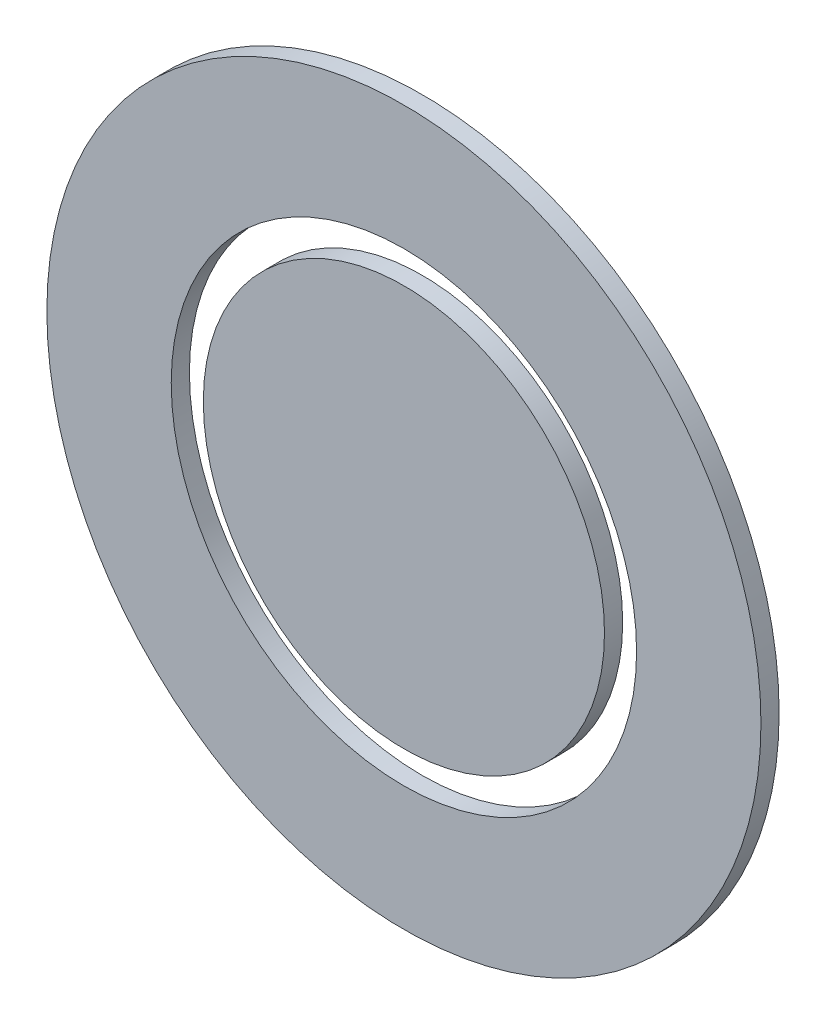
ISO-10303-21;
HEADER;
FILE_DESCRIPTION(('STEP AP214'),'2;1');
FILE_NAME('part.step','',(''),(''),'','','');
FILE_SCHEMA(('AUTOMOTIVE_DESIGN { 1 0 10303 214 1 1 1 1 }'));
ENDSEC;
DATA;
#1=APPLICATION_CONTEXT('core data for automotive mechanical design processes');
#2=APPLICATION_PROTOCOL_DEFINITION('international standard','automotive_design',2000,#1);
#3=PRODUCT_CONTEXT('',#1,'mechanical');
#4=PRODUCT('Part','Part','',(#3));
#5=PRODUCT_RELATED_PRODUCT_CATEGORY('part','',(#4));
#6=PRODUCT_DEFINITION_FORMATION('','',#4);
#7=PRODUCT_DEFINITION_CONTEXT('part definition',#1,'design');
#8=PRODUCT_DEFINITION('design','',#6,#7);
#9=PRODUCT_DEFINITION_SHAPE('','',#8);
#10=(LENGTH_UNIT() NAMED_UNIT(*) SI_UNIT(.MILLI.,.METRE.));
#11=(NAMED_UNIT(*) PLANE_ANGLE_UNIT() SI_UNIT($,.RADIAN.));
#12=(NAMED_UNIT(*) SI_UNIT($,.STERADIAN.) SOLID_ANGLE_UNIT());
#13=UNCERTAINTY_MEASURE_WITH_UNIT(LENGTH_MEASURE(1.E-05),#10,'distance_accuracy_value','');
#14=(GEOMETRIC_REPRESENTATION_CONTEXT(3) GLOBAL_UNCERTAINTY_ASSIGNED_CONTEXT((#13)) GLOBAL_UNIT_ASSIGNED_CONTEXT((#10,
#11,#12)) REPRESENTATION_CONTEXT('',''));
#15=CARTESIAN_POINT('',(0.,0.,0.));
#16=DIRECTION('',(0.,0.,1.));
#17=DIRECTION('',(1.,0.,0.));
#18=AXIS2_PLACEMENT_3D('',#15,#16,#17);
#19=CARTESIAN_POINT('',(0.,0.,6.8));
#20=DIRECTION('',(0.,0.,1.));
#21=DIRECTION('',(1.,0.,0.));
#22=AXIS2_PLACEMENT_3D('',#19,#20,#21);
#23=PLANE('',#22);
#24=CARTESIAN_POINT('',(0.,0.,6.8));
#25=DIRECTION('',(0.,0.,1.));
#26=DIRECTION('',(1.,0.,0.));
#27=AXIS2_PLACEMENT_3D('',#24,#25,#26);
#28=CIRCLE('',#27,133.5);
#29=CARTESIAN_POINT('',(133.5,0.,6.8));
#30=VERTEX_POINT('',#29);
#31=EDGE_CURVE('E12',#30,#30,#28,.T.);
#32=ORIENTED_EDGE('',*,*,#31,.T.);
#33=EDGE_LOOP('',(#32));
#34=FACE_BOUND('',#33,.T.);
#35=CARTESIAN_POINT('',(0.,0.,6.8));
#36=DIRECTION('',(0.,0.,1.));
#37=DIRECTION('',(1.,0.,0.));
#38=AXIS2_PLACEMENT_3D('',#35,#36,#37);
#39=CIRCLE('',#38,87.);
#40=CARTESIAN_POINT('',(87.,0.,6.8));
#41=VERTEX_POINT('',#40);
#42=EDGE_CURVE('E57',#41,#41,#39,.T.);
#43=ORIENTED_EDGE('',*,*,#42,.F.);
#44=EDGE_LOOP('',(#43));
#45=FACE_BOUND('',#44,.T.);
#46=ADVANCED_FACE('F46',(#34,#45),#23,.T.);
#47=CARTESIAN_POINT('',(0.,0.,0.));
#48=DIRECTION('',(0.,0.,1.));
#49=DIRECTION('',(1.,0.,0.));
#50=AXIS2_PLACEMENT_3D('',#47,#48,#49);
#51=PLANE('',#50);
#52=CARTESIAN_POINT('',(0.,0.,0.));
#53=DIRECTION('',(0.,0.,1.));
#54=DIRECTION('',(1.,0.,0.));
#55=AXIS2_PLACEMENT_3D('',#52,#53,#54);
#56=CIRCLE('',#55,133.5);
#57=CARTESIAN_POINT('',(133.5,0.,0.));
#58=VERTEX_POINT('',#57);
#59=EDGE_CURVE('E50',#58,#58,#56,.T.);
#60=ORIENTED_EDGE('',*,*,#59,.F.);
#61=EDGE_LOOP('',(#60));
#62=FACE_BOUND('',#61,.T.);
#63=CARTESIAN_POINT('',(0.,0.,0.));
#64=DIRECTION('',(0.,0.,1.));
#65=DIRECTION('',(1.,0.,0.));
#66=AXIS2_PLACEMENT_3D('',#63,#64,#65);
#67=CIRCLE('',#66,87.);
#68=CARTESIAN_POINT('',(87.,0.,0.));
#69=VERTEX_POINT('',#68);
#70=EDGE_CURVE('E59',#69,#69,#67,.T.);
#71=ORIENTED_EDGE('',*,*,#70,.T.);
#72=EDGE_LOOP('',(#71));
#73=FACE_BOUND('',#72,.T.);
#74=ADVANCED_FACE('F69',(#62,#73),#51,.F.);
#75=CARTESIAN_POINT('',(0.,0.,6.8));
#76=DIRECTION('',(0.,0.,-1.));
#77=DIRECTION('',(-1.,0.,0.));
#78=AXIS2_PLACEMENT_3D('',#75,#76,#77);
#79=CYLINDRICAL_SURFACE('',#78,133.5);
#80=ORIENTED_EDGE('',*,*,#31,.F.);
#81=EDGE_LOOP('',(#80));
#82=FACE_BOUND('',#81,.T.);
#83=ORIENTED_EDGE('',*,*,#59,.T.);
#84=EDGE_LOOP('',(#83));
#85=FACE_BOUND('',#84,.T.);
#86=ADVANCED_FACE('F48',(#82,#85),#79,.T.);
#87=CARTESIAN_POINT('',(0.,0.,6.8));
#88=DIRECTION('',(0.,0.,-1.));
#89=DIRECTION('',(-1.,0.,0.));
#90=AXIS2_PLACEMENT_3D('',#87,#88,#89);
#91=CYLINDRICAL_SURFACE('',#90,87.);
#92=ORIENTED_EDGE('',*,*,#42,.T.);
#93=EDGE_LOOP('',(#92));
#94=FACE_BOUND('',#93,.T.);
#95=ORIENTED_EDGE('',*,*,#70,.F.);
#96=EDGE_LOOP('',(#95));
#97=FACE_BOUND('',#96,.T.);
#98=ADVANCED_FACE('F65',(#94,#97),#91,.F.);
#99=CLOSED_SHELL('',(#46,#74,#86,#98));
#100=MANIFOLD_SOLID_BREP('B2',#99);
#101=CARTESIAN_POINT('',(0.,0.,6.8));
#102=DIRECTION('',(0.,0.,-1.));
#103=DIRECTION('',(-1.,0.,0.));
#104=AXIS2_PLACEMENT_3D('',#101,#102,#103);
#105=CYLINDRICAL_SURFACE('',#104,75.);
#106=CARTESIAN_POINT('',(0.,0.,6.8));
#107=DIRECTION('',(0.,0.,1.));
#108=DIRECTION('',(1.,0.,0.));
#109=AXIS2_PLACEMENT_3D('',#106,#107,#108);
#110=CIRCLE('',#109,75.);
#111=CARTESIAN_POINT('',(75.,0.,6.8));
#112=VERTEX_POINT('',#111);
#113=EDGE_CURVE('E45',#112,#112,#110,.T.);
#114=ORIENTED_EDGE('',*,*,#113,.F.);
#115=EDGE_LOOP('',(#114));
#116=FACE_BOUND('',#115,.T.);
#117=CARTESIAN_POINT('',(0.,0.,0.));
#118=DIRECTION('',(0.,0.,1.));
#119=DIRECTION('',(1.,0.,0.));
#120=AXIS2_PLACEMENT_3D('',#117,#118,#119);
#121=CIRCLE('',#120,75.);
#122=CARTESIAN_POINT('',(75.,0.,0.));
#123=VERTEX_POINT('',#122);
#124=EDGE_CURVE('E110',#123,#123,#121,.T.);
#125=ORIENTED_EDGE('',*,*,#124,.T.);
#126=EDGE_LOOP('',(#125));
#127=FACE_BOUND('',#126,.T.);
#128=ADVANCED_FACE('F107',(#116,#127),#105,.T.);
#129=CARTESIAN_POINT('',(0.,0.,6.8));
#130=DIRECTION('',(0.,0.,1.));
#131=DIRECTION('',(1.,0.,0.));
#132=AXIS2_PLACEMENT_3D('',#129,#130,#131);
#133=PLANE('',#132);
#134=ORIENTED_EDGE('',*,*,#113,.T.);
#135=EDGE_LOOP('',(#134));
#136=FACE_BOUND('',#135,.T.);
#137=ADVANCED_FACE('F122',(#136),#133,.T.);
#138=CARTESIAN_POINT('',(0.,0.,0.));
#139=DIRECTION('',(0.,0.,1.));
#140=DIRECTION('',(1.,0.,0.));
#141=AXIS2_PLACEMENT_3D('',#138,#139,#140);
#142=PLANE('',#141);
#143=ORIENTED_EDGE('',*,*,#124,.F.);
#144=EDGE_LOOP('',(#143));
#145=FACE_BOUND('',#144,.T.);
#146=ADVANCED_FACE('F120',(#145),#142,.F.);
#147=CLOSED_SHELL('',(#128,#137,#146));
#148=MANIFOLD_SOLID_BREP('B7',#147);
#149=ADVANCED_BREP_SHAPE_REPRESENTATION('',(#18,#100,#148),#14);
#150=SHAPE_DEFINITION_REPRESENTATION(#9,#149);
ENDSEC;
END-ISO-10303-21;
